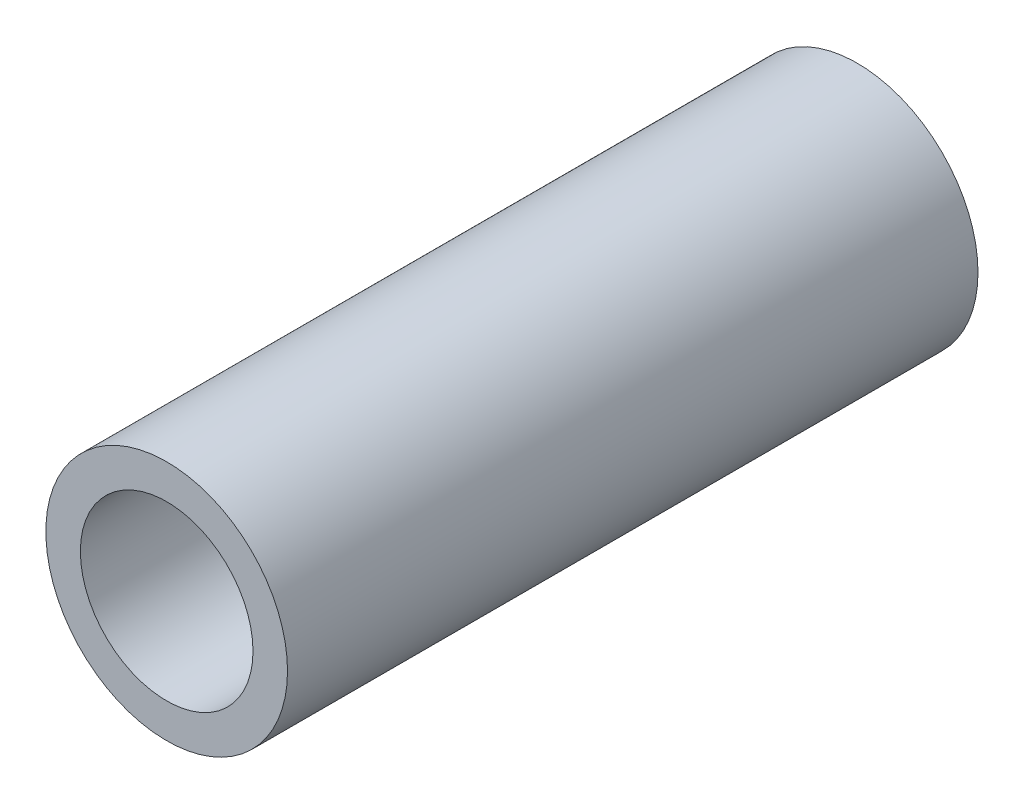
ISO-10303-21;
HEADER;
FILE_DESCRIPTION(('STEP AP214'),'2;1');
FILE_NAME('part.step','',(''),(''),'','','');
FILE_SCHEMA(('AUTOMOTIVE_DESIGN { 1 0 10303 214 1 1 1 1 }'));
ENDSEC;
DATA;
#1=APPLICATION_CONTEXT('core data for automotive mechanical design processes');
#2=APPLICATION_PROTOCOL_DEFINITION('international standard','automotive_design',2000,#1);
#3=PRODUCT_CONTEXT('',#1,'mechanical');
#4=PRODUCT('Part','Part','',(#3));
#5=PRODUCT_RELATED_PRODUCT_CATEGORY('part','',(#4));
#6=PRODUCT_DEFINITION_FORMATION('','',#4);
#7=PRODUCT_DEFINITION_CONTEXT('part definition',#1,'design');
#8=PRODUCT_DEFINITION('design','',#6,#7);
#9=PRODUCT_DEFINITION_SHAPE('','',#8);
#10=(LENGTH_UNIT() NAMED_UNIT(*) SI_UNIT(.MILLI.,.METRE.));
#11=(NAMED_UNIT(*) PLANE_ANGLE_UNIT() SI_UNIT($,.RADIAN.));
#12=(NAMED_UNIT(*) SI_UNIT($,.STERADIAN.) SOLID_ANGLE_UNIT());
#13=UNCERTAINTY_MEASURE_WITH_UNIT(LENGTH_MEASURE(1.E-05),#10,'distance_accuracy_value','');
#14=(GEOMETRIC_REPRESENTATION_CONTEXT(3) GLOBAL_UNCERTAINTY_ASSIGNED_CONTEXT((#13)) GLOBAL_UNIT_ASSIGNED_CONTEXT((#10,
#11,#12)) REPRESENTATION_CONTEXT('',''));
#15=CARTESIAN_POINT('',(0.,0.,0.));
#16=DIRECTION('',(0.,0.,1.));
#17=DIRECTION('',(1.,0.,0.));
#18=AXIS2_PLACEMENT_3D('',#15,#16,#17);
#19=CARTESIAN_POINT('',(0.,0.,50.8));
#20=DIRECTION('',(0.,0.,-1.));
#21=DIRECTION('',(-1.,0.,0.));
#22=AXIS2_PLACEMENT_3D('',#19,#20,#21);
#23=CYLINDRICAL_SURFACE('',#22,6.35);
#24=CARTESIAN_POINT('',(0.,0.,50.8));
#25=DIRECTION('',(0.,0.,1.));
#26=DIRECTION('',(1.,0.,0.));
#27=AXIS2_PLACEMENT_3D('',#24,#25,#26);
#28=CIRCLE('',#27,6.35);
#29=CARTESIAN_POINT('',(6.35,0.,50.8));
#30=VERTEX_POINT('',#29);
#31=EDGE_CURVE('E48',#30,#30,#28,.T.);
#32=ORIENTED_EDGE('',*,*,#31,.T.);
#33=EDGE_LOOP('',(#32));
#34=FACE_BOUND('',#33,.T.);
#35=CARTESIAN_POINT('',(0.,0.,2.54));
#36=DIRECTION('',(0.,0.,-1.));
#37=DIRECTION('',(-1.,0.,0.));
#38=AXIS2_PLACEMENT_3D('',#35,#36,#37);
#39=CIRCLE('',#38,6.35);
#40=CARTESIAN_POINT('',(-6.35,0.,2.54));
#41=VERTEX_POINT('',#40);
#42=EDGE_CURVE('E52',#41,#41,#39,.T.);
#43=ORIENTED_EDGE('',*,*,#42,.T.);
#44=EDGE_LOOP('',(#43));
#45=FACE_BOUND('',#44,.T.);
#46=ADVANCED_FACE('F37',(#34,#45),#23,.F.);
#47=CARTESIAN_POINT('',(0.,0.,50.8));
#48=DIRECTION('',(0.,0.,1.));
#49=DIRECTION('',(1.,0.,0.));
#50=AXIS2_PLACEMENT_3D('',#47,#48,#49);
#51=PLANE('',#50);
#52=CARTESIAN_POINT('',(0.,0.,50.8));
#53=DIRECTION('',(0.,0.,1.));
#54=DIRECTION('',(1.,0.,0.));
#55=AXIS2_PLACEMENT_3D('',#52,#53,#54);
#56=CIRCLE('',#55,8.89);
#57=CARTESIAN_POINT('',(8.89,0.,50.8));
#58=VERTEX_POINT('',#57);
#59=EDGE_CURVE('E11',#58,#58,#56,.T.);
#60=ORIENTED_EDGE('',*,*,#59,.T.);
#61=EDGE_LOOP('',(#60));
#62=FACE_BOUND('',#61,.T.);
#63=ORIENTED_EDGE('',*,*,#31,.F.);
#64=EDGE_LOOP('',(#63));
#65=FACE_BOUND('',#64,.T.);
#66=ADVANCED_FACE('F67',(#62,#65),#51,.T.);
#67=CARTESIAN_POINT('',(0.,0.,0.));
#68=DIRECTION('',(0.,0.,1.));
#69=DIRECTION('',(1.,0.,0.));
#70=AXIS2_PLACEMENT_3D('',#67,#68,#69);
#71=PLANE('',#70);
#72=CARTESIAN_POINT('',(0.,0.,0.));
#73=DIRECTION('',(0.,0.,1.));
#74=DIRECTION('',(1.,0.,0.));
#75=AXIS2_PLACEMENT_3D('',#72,#73,#74);
#76=CIRCLE('',#75,8.89);
#77=CARTESIAN_POINT('',(8.89,0.,0.));
#78=VERTEX_POINT('',#77);
#79=EDGE_CURVE('E41',#78,#78,#76,.T.);
#80=ORIENTED_EDGE('',*,*,#79,.F.);
#81=EDGE_LOOP('',(#80));
#82=FACE_BOUND('',#81,.T.);
#83=ADVANCED_FACE('F63',(#82),#71,.F.);
#84=CARTESIAN_POINT('',(0.,0.,50.8));
#85=DIRECTION('',(0.,0.,-1.));
#86=DIRECTION('',(-1.,0.,0.));
#87=AXIS2_PLACEMENT_3D('',#84,#85,#86);
#88=CYLINDRICAL_SURFACE('',#87,8.89);
#89=ORIENTED_EDGE('',*,*,#59,.F.);
#90=EDGE_LOOP('',(#89));
#91=FACE_BOUND('',#90,.T.);
#92=ORIENTED_EDGE('',*,*,#79,.T.);
#93=EDGE_LOOP('',(#92));
#94=FACE_BOUND('',#93,.T.);
#95=ADVANCED_FACE('F39',(#91,#94),#88,.T.);
#96=CARTESIAN_POINT('',(0.,0.,2.54));
#97=DIRECTION('',(0.,0.,-1.));
#98=DIRECTION('',(-1.,0.,0.));
#99=AXIS2_PLACEMENT_3D('',#96,#97,#98);
#100=PLANE('',#99);
#101=ORIENTED_EDGE('',*,*,#42,.F.);
#102=EDGE_LOOP('',(#101));
#103=FACE_BOUND('',#102,.T.);
#104=ADVANCED_FACE('F57',(#103),#100,.F.);
#105=CLOSED_SHELL('',(#46,#66,#83,#95,#104));
#106=MANIFOLD_SOLID_BREP('B2',#105);
#107=ADVANCED_BREP_SHAPE_REPRESENTATION('',(#18,#106),#14);
#108=SHAPE_DEFINITION_REPRESENTATION(#9,#107);
ENDSEC;
END-ISO-10303-21;
